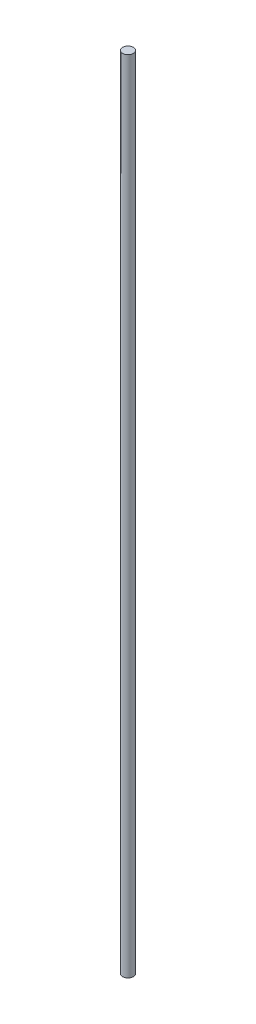
ISO-10303-21;
HEADER;
FILE_DESCRIPTION(('STEP AP214'),'2;1');
FILE_NAME('part.step','',(''),(''),'','','');
FILE_SCHEMA(('AUTOMOTIVE_DESIGN { 1 0 10303 214 1 1 1 1 }'));
ENDSEC;
DATA;
#1=APPLICATION_CONTEXT('core data for automotive mechanical design processes');
#2=APPLICATION_PROTOCOL_DEFINITION('international standard','automotive_design',2000,#1);
#3=PRODUCT_CONTEXT('',#1,'mechanical');
#4=PRODUCT('Part','Part','',(#3));
#5=PRODUCT_RELATED_PRODUCT_CATEGORY('part','',(#4));
#6=PRODUCT_DEFINITION_FORMATION('','',#4);
#7=PRODUCT_DEFINITION_CONTEXT('part definition',#1,'design');
#8=PRODUCT_DEFINITION('design','',#6,#7);
#9=PRODUCT_DEFINITION_SHAPE('','',#8);
#10=(LENGTH_UNIT() NAMED_UNIT(*) SI_UNIT(.MILLI.,.METRE.));
#11=(NAMED_UNIT(*) PLANE_ANGLE_UNIT() SI_UNIT($,.RADIAN.));
#12=(NAMED_UNIT(*) SI_UNIT($,.STERADIAN.) SOLID_ANGLE_UNIT());
#13=UNCERTAINTY_MEASURE_WITH_UNIT(LENGTH_MEASURE(1.E-05),#10,'distance_accuracy_value','');
#14=(GEOMETRIC_REPRESENTATION_CONTEXT(3) GLOBAL_UNCERTAINTY_ASSIGNED_CONTEXT((#13)) GLOBAL_UNIT_ASSIGNED_CONTEXT((#10,
#11,#12)) REPRESENTATION_CONTEXT('',''));
#15=CARTESIAN_POINT('',(0.,0.,0.));
#16=DIRECTION('',(0.,0.,1.));
#17=DIRECTION('',(1.,0.,0.));
#18=AXIS2_PLACEMENT_3D('',#15,#16,#17);
#19=CARTESIAN_POINT('',(0.,600.,0.));
#20=DIRECTION('',(0.,-1.,0.));
#21=DIRECTION('',(0.,0.,-1.));
#22=AXIS2_PLACEMENT_3D('',#19,#20,#21);
#23=CYLINDRICAL_SURFACE('',#22,4.);
#24=CARTESIAN_POINT('',(0.,600.,0.));
#25=DIRECTION('',(0.,1.,0.));
#26=DIRECTION('',(0.,0.,1.));
#27=AXIS2_PLACEMENT_3D('',#24,#25,#26);
#28=CIRCLE('',#27,4.);
#29=CARTESIAN_POINT('',(0.,600.,4.));
#30=VERTEX_POINT('',#29);
#31=EDGE_CURVE('E10',#30,#30,#28,.T.);
#32=ORIENTED_EDGE('',*,*,#31,.F.);
#33=EDGE_LOOP('',(#32));
#34=FACE_BOUND('',#33,.T.);
#35=CARTESIAN_POINT('',(0.,0.,0.));
#36=DIRECTION('',(0.,1.,0.));
#37=DIRECTION('',(0.,0.,1.));
#38=AXIS2_PLACEMENT_3D('',#35,#36,#37);
#39=CIRCLE('',#38,4.);
#40=CARTESIAN_POINT('',(0.,0.,4.));
#41=VERTEX_POINT('',#40);
#42=EDGE_CURVE('E39',#41,#41,#39,.T.);
#43=ORIENTED_EDGE('',*,*,#42,.T.);
#44=EDGE_LOOP('',(#43));
#45=FACE_BOUND('',#44,.T.);
#46=ADVANCED_FACE('F36',(#34,#45),#23,.T.);
#47=CARTESIAN_POINT('',(0.,600.,0.));
#48=DIRECTION('',(0.,1.,0.));
#49=DIRECTION('',(0.,0.,1.));
#50=AXIS2_PLACEMENT_3D('',#47,#48,#49);
#51=PLANE('',#50);
#52=ORIENTED_EDGE('',*,*,#31,.T.);
#53=EDGE_LOOP('',(#52));
#54=FACE_BOUND('',#53,.T.);
#55=ADVANCED_FACE('F53',(#54),#51,.T.);
#56=CARTESIAN_POINT('',(0.,0.,0.));
#57=DIRECTION('',(0.,1.,0.));
#58=DIRECTION('',(0.,0.,1.));
#59=AXIS2_PLACEMENT_3D('',#56,#57,#58);
#60=PLANE('',#59);
#61=ORIENTED_EDGE('',*,*,#42,.F.);
#62=EDGE_LOOP('',(#61));
#63=FACE_BOUND('',#62,.T.);
#64=ADVANCED_FACE('F51',(#63),#60,.F.);
#65=CLOSED_SHELL('',(#46,#55,#64));
#66=MANIFOLD_SOLID_BREP('B2',#65);
#67=ADVANCED_BREP_SHAPE_REPRESENTATION('',(#18,#66),#14);
#68=SHAPE_DEFINITION_REPRESENTATION(#9,#67);
ENDSEC;
END-ISO-10303-21;
